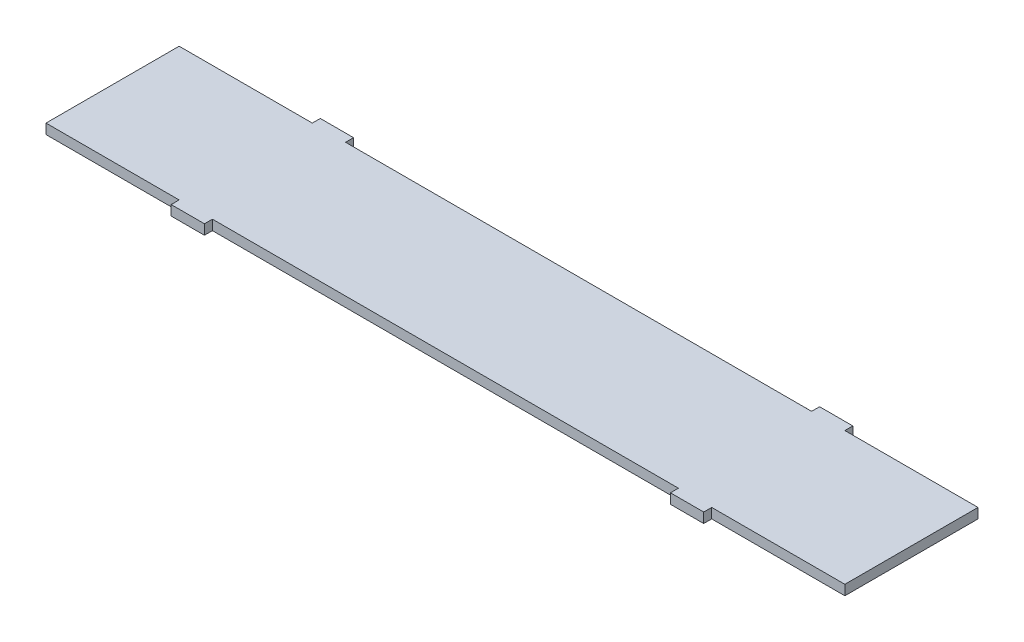
ISO-10303-21;
HEADER;
FILE_DESCRIPTION(('STEP AP214'),'2;1');
FILE_NAME('part.step','',(''),(''),'','','');
FILE_SCHEMA(('AUTOMOTIVE_DESIGN { 1 0 10303 214 1 1 1 1 }'));
ENDSEC;
DATA;
#1=APPLICATION_CONTEXT('core data for automotive mechanical design processes');
#2=APPLICATION_PROTOCOL_DEFINITION('international standard','automotive_design',2000,#1);
#3=PRODUCT_CONTEXT('',#1,'mechanical');
#4=PRODUCT('Part','Part','',(#3));
#5=PRODUCT_RELATED_PRODUCT_CATEGORY('part','',(#4));
#6=PRODUCT_DEFINITION_FORMATION('','',#4);
#7=PRODUCT_DEFINITION_CONTEXT('part definition',#1,'design');
#8=PRODUCT_DEFINITION('design','',#6,#7);
#9=PRODUCT_DEFINITION_SHAPE('','',#8);
#10=(LENGTH_UNIT() NAMED_UNIT(*) SI_UNIT(.MILLI.,.METRE.));
#11=(NAMED_UNIT(*) PLANE_ANGLE_UNIT() SI_UNIT($,.RADIAN.));
#12=(NAMED_UNIT(*) SI_UNIT($,.STERADIAN.) SOLID_ANGLE_UNIT());
#13=UNCERTAINTY_MEASURE_WITH_UNIT(LENGTH_MEASURE(1.E-05),#10,'distance_accuracy_value','');
#14=(GEOMETRIC_REPRESENTATION_CONTEXT(3) GLOBAL_UNCERTAINTY_ASSIGNED_CONTEXT((#13)) GLOBAL_UNIT_ASSIGNED_CONTEXT((#10,
#11,#12)) REPRESENTATION_CONTEXT('',''));
#15=CARTESIAN_POINT('',(0.,0.,0.));
#16=DIRECTION('',(0.,0.,1.));
#17=DIRECTION('',(1.,0.,0.));
#18=AXIS2_PLACEMENT_3D('',#15,#16,#17);
#19=CARTESIAN_POINT('',(-600.,15.,-100.));
#20=DIRECTION('',(0.,0.,1.));
#21=DIRECTION('',(1.,0.,0.));
#22=AXIS2_PLACEMENT_3D('',#19,#20,#21);
#23=PLANE('',#22);
#24=DIRECTION('',(0.,-1.,0.));
#25=VECTOR('',#24,1.);
#26=CARTESIAN_POINT('',(400.,15.,-100.));
#27=LINE('',#26,#25);
#28=CARTESIAN_POINT('',(400.,15.,-100.));
#29=VERTEX_POINT('',#28);
#30=CARTESIAN_POINT('',(400.,0.,-100.));
#31=VERTEX_POINT('',#30);
#32=EDGE_CURVE('E66',#29,#31,#27,.T.);
#33=ORIENTED_EDGE('',*,*,#32,.F.);
#34=DIRECTION('',(-1.,0.,0.));
#35=VECTOR('',#34,1.);
#36=CARTESIAN_POINT('',(-600.,15.,-100.));
#37=LINE('',#36,#35);
#38=CARTESIAN_POINT('',(600.,15.,-100.));
#39=VERTEX_POINT('',#38);
#40=EDGE_CURVE('E198',#39,#29,#37,.T.);
#41=ORIENTED_EDGE('',*,*,#40,.F.);
#42=DIRECTION('',(0.,-1.,0.));
#43=VECTOR('',#42,1.);
#44=CARTESIAN_POINT('',(600.,15.,-100.));
#45=LINE('',#44,#43);
#46=CARTESIAN_POINT('',(600.,0.,-100.));
#47=VERTEX_POINT('',#46);
#48=EDGE_CURVE('E12',#39,#47,#45,.T.);
#49=ORIENTED_EDGE('',*,*,#48,.T.);
#50=DIRECTION('',(-1.,0.,0.));
#51=VECTOR('',#50,1.);
#52=CARTESIAN_POINT('',(-600.,0.,-100.));
#53=LINE('',#52,#51);
#54=EDGE_CURVE('E356',#47,#31,#53,.T.);
#55=ORIENTED_EDGE('',*,*,#54,.T.);
#56=EDGE_LOOP('',(#33,#41,#49,#55));
#57=FACE_BOUND('',#56,.T.);
#58=ADVANCED_FACE('F42',(#57),#23,.F.);
#59=DIRECTION('',(0.,-1.,0.));
#60=VECTOR('',#59,1.);
#61=CARTESIAN_POINT('',(350.,15.,-100.));
#62=LINE('',#61,#60);
#63=CARTESIAN_POINT('',(350.,15.,-100.));
#64=VERTEX_POINT('',#63);
#65=CARTESIAN_POINT('',(350.,0.,-100.));
#66=VERTEX_POINT('',#65);
#67=EDGE_CURVE('E213',#64,#66,#62,.T.);
#68=ORIENTED_EDGE('',*,*,#67,.T.);
#69=CARTESIAN_POINT('',(-350.,0.,-100.));
#70=VERTEX_POINT('',#69);
#71=EDGE_CURVE('E344',#66,#70,#53,.T.);
#72=ORIENTED_EDGE('',*,*,#71,.T.);
#73=DIRECTION('',(0.,-1.,0.));
#74=VECTOR('',#73,1.);
#75=CARTESIAN_POINT('',(-350.,15.,-100.));
#76=LINE('',#75,#74);
#77=CARTESIAN_POINT('',(-350.,15.,-100.));
#78=VERTEX_POINT('',#77);
#79=EDGE_CURVE('E423',#78,#70,#76,.T.);
#80=ORIENTED_EDGE('',*,*,#79,.F.);
#81=EDGE_CURVE('E58',#64,#78,#37,.T.);
#82=ORIENTED_EDGE('',*,*,#81,.F.);
#83=EDGE_LOOP('',(#68,#72,#80,#82));
#84=FACE_BOUND('',#83,.T.);
#85=ADVANCED_FACE('F343',(#84),#23,.F.);
#86=CARTESIAN_POINT('',(-600.,15.,100.));
#87=DIRECTION('',(0.,0.,-1.));
#88=DIRECTION('',(-1.,0.,0.));
#89=AXIS2_PLACEMENT_3D('',#86,#87,#88);
#90=PLANE('',#89);
#91=DIRECTION('',(0.,-1.,0.));
#92=VECTOR('',#91,1.);
#93=CARTESIAN_POINT('',(350.,15.,100.));
#94=LINE('',#93,#92);
#95=CARTESIAN_POINT('',(350.,15.,100.));
#96=VERTEX_POINT('',#95);
#97=CARTESIAN_POINT('',(350.,0.,100.));
#98=VERTEX_POINT('',#97);
#99=EDGE_CURVE('E251',#96,#98,#94,.T.);
#100=ORIENTED_EDGE('',*,*,#99,.F.);
#101=DIRECTION('',(1.,0.,0.));
#102=VECTOR('',#101,1.);
#103=CARTESIAN_POINT('',(-600.,15.,100.));
#104=LINE('',#103,#102);
#105=CARTESIAN_POINT('',(-350.,15.,100.));
#106=VERTEX_POINT('',#105);
#107=EDGE_CURVE('E401',#106,#96,#104,.T.);
#108=ORIENTED_EDGE('',*,*,#107,.F.);
#109=DIRECTION('',(0.,-1.,0.));
#110=VECTOR('',#109,1.);
#111=CARTESIAN_POINT('',(-350.,15.,100.));
#112=LINE('',#111,#110);
#113=CARTESIAN_POINT('',(-350.,0.,100.));
#114=VERTEX_POINT('',#113);
#115=EDGE_CURVE('E272',#106,#114,#112,.T.);
#116=ORIENTED_EDGE('',*,*,#115,.T.);
#117=DIRECTION('',(1.,0.,0.));
#118=VECTOR('',#117,1.);
#119=CARTESIAN_POINT('',(-600.,0.,100.));
#120=LINE('',#119,#118);
#121=EDGE_CURVE('E372',#114,#98,#120,.T.);
#122=ORIENTED_EDGE('',*,*,#121,.T.);
#123=EDGE_LOOP('',(#100,#108,#116,#122));
#124=FACE_BOUND('',#123,.T.);
#125=ADVANCED_FACE('F468',(#124),#90,.F.);
#126=DIRECTION('',(0.,-1.,0.));
#127=VECTOR('',#126,1.);
#128=CARTESIAN_POINT('',(400.,15.,100.));
#129=LINE('',#128,#127);
#130=CARTESIAN_POINT('',(400.,15.,100.));
#131=VERTEX_POINT('',#130);
#132=CARTESIAN_POINT('',(400.,0.,100.));
#133=VERTEX_POINT('',#132);
#134=EDGE_CURVE('E233',#131,#133,#129,.T.);
#135=ORIENTED_EDGE('',*,*,#134,.T.);
#136=CARTESIAN_POINT('',(600.,0.,100.));
#137=VERTEX_POINT('',#136);
#138=EDGE_CURVE('E367',#133,#137,#120,.T.);
#139=ORIENTED_EDGE('',*,*,#138,.T.);
#140=DIRECTION('',(0.,-1.,0.));
#141=VECTOR('',#140,1.);
#142=CARTESIAN_POINT('',(600.,15.,100.));
#143=LINE('',#142,#141);
#144=CARTESIAN_POINT('',(600.,15.,100.));
#145=VERTEX_POINT('',#144);
#146=EDGE_CURVE('E373',#145,#137,#143,.T.);
#147=ORIENTED_EDGE('',*,*,#146,.F.);
#148=EDGE_CURVE('E402',#131,#145,#104,.T.);
#149=ORIENTED_EDGE('',*,*,#148,.F.);
#150=EDGE_LOOP('',(#135,#139,#147,#149));
#151=FACE_BOUND('',#150,.T.);
#152=ADVANCED_FACE('F478',(#151),#90,.F.);
#153=DIRECTION('',(0.,-1.,0.));
#154=VECTOR('',#153,1.);
#155=CARTESIAN_POINT('',(-400.,15.,100.));
#156=LINE('',#155,#154);
#157=CARTESIAN_POINT('',(-400.,15.,100.));
#158=VERTEX_POINT('',#157);
#159=CARTESIAN_POINT('',(-400.,0.,100.));
#160=VERTEX_POINT('',#159);
#161=EDGE_CURVE('E291',#158,#160,#156,.T.);
#162=ORIENTED_EDGE('',*,*,#161,.F.);
#163=CARTESIAN_POINT('',(-600.,15.,100.));
#164=VERTEX_POINT('',#163);
#165=EDGE_CURVE('E378',#164,#158,#104,.T.);
#166=ORIENTED_EDGE('',*,*,#165,.F.);
#167=DIRECTION('',(0.,-1.,0.));
#168=VECTOR('',#167,1.);
#169=CARTESIAN_POINT('',(-600.,15.,100.));
#170=LINE('',#169,#168);
#171=CARTESIAN_POINT('',(-600.,0.,100.));
#172=VERTEX_POINT('',#171);
#173=EDGE_CURVE('E377',#164,#172,#170,.T.);
#174=ORIENTED_EDGE('',*,*,#173,.T.);
#175=EDGE_CURVE('E368',#172,#160,#120,.T.);
#176=ORIENTED_EDGE('',*,*,#175,.T.);
#177=EDGE_LOOP('',(#162,#166,#174,#176));
#178=FACE_BOUND('',#177,.T.);
#179=ADVANCED_FACE('F397',(#178),#90,.F.);
#180=CARTESIAN_POINT('',(600.,15.,100.));
#181=DIRECTION('',(-1.,0.,0.));
#182=DIRECTION('',(0.,0.,1.));
#183=AXIS2_PLACEMENT_3D('',#180,#181,#182);
#184=PLANE('',#183);
#185=DIRECTION('',(0.,0.,-1.));
#186=VECTOR('',#185,1.);
#187=CARTESIAN_POINT('',(600.,0.,100.));
#188=LINE('',#187,#186);
#189=EDGE_CURVE('E362',#137,#47,#188,.T.);
#190=ORIENTED_EDGE('',*,*,#189,.T.);
#191=ORIENTED_EDGE('',*,*,#48,.F.);
#192=DIRECTION('',(0.,0.,-1.));
#193=VECTOR('',#192,1.);
#194=CARTESIAN_POINT('',(600.,15.,100.));
#195=LINE('',#194,#193);
#196=EDGE_CURVE('E315',#145,#39,#195,.T.);
#197=ORIENTED_EDGE('',*,*,#196,.F.);
#198=ORIENTED_EDGE('',*,*,#146,.T.);
#199=EDGE_LOOP('',(#190,#191,#197,#198));
#200=FACE_BOUND('',#199,.T.);
#201=ADVANCED_FACE('F44',(#200),#184,.F.);
#202=CARTESIAN_POINT('',(-400.,15.,-100.));
#203=VERTEX_POINT('',#202);
#204=CARTESIAN_POINT('',(-600.,15.,-100.));
#205=VERTEX_POINT('',#204);
#206=EDGE_CURVE('E314',#203,#205,#37,.T.);
#207=ORIENTED_EDGE('',*,*,#206,.F.);
#208=DIRECTION('',(0.,-1.,0.));
#209=VECTOR('',#208,1.);
#210=CARTESIAN_POINT('',(-400.,15.,-100.));
#211=LINE('',#210,#209);
#212=CARTESIAN_POINT('',(-400.,0.,-100.));
#213=VERTEX_POINT('',#212);
#214=EDGE_CURVE('E421',#203,#213,#211,.T.);
#215=ORIENTED_EDGE('',*,*,#214,.T.);
#216=CARTESIAN_POINT('',(-600.,0.,-100.));
#217=VERTEX_POINT('',#216);
#218=EDGE_CURVE('E357',#213,#217,#53,.T.);
#219=ORIENTED_EDGE('',*,*,#218,.T.);
#220=DIRECTION('',(0.,-1.,0.));
#221=VECTOR('',#220,1.);
#222=CARTESIAN_POINT('',(-600.,15.,-100.));
#223=LINE('',#222,#221);
#224=EDGE_CURVE('E51',#205,#217,#223,.T.);
#225=ORIENTED_EDGE('',*,*,#224,.F.);
#226=EDGE_LOOP('',(#207,#215,#219,#225));
#227=FACE_BOUND('',#226,.T.);
#228=ADVANCED_FACE('F464',(#227),#23,.F.);
#229=CARTESIAN_POINT('',(-600.,15.,100.));
#230=DIRECTION('',(1.,0.,0.));
#231=DIRECTION('',(0.,0.,-1.));
#232=AXIS2_PLACEMENT_3D('',#229,#230,#231);
#233=PLANE('',#232);
#234=DIRECTION('',(0.,0.,1.));
#235=VECTOR('',#234,1.);
#236=CARTESIAN_POINT('',(-600.,0.,100.));
#237=LINE('',#236,#235);
#238=EDGE_CURVE('E361',#217,#172,#237,.T.);
#239=ORIENTED_EDGE('',*,*,#238,.T.);
#240=ORIENTED_EDGE('',*,*,#173,.F.);
#241=DIRECTION('',(0.,0.,1.));
#242=VECTOR('',#241,1.);
#243=CARTESIAN_POINT('',(-600.,15.,100.));
#244=LINE('',#243,#242);
#245=EDGE_CURVE('E313',#205,#164,#244,.T.);
#246=ORIENTED_EDGE('',*,*,#245,.F.);
#247=ORIENTED_EDGE('',*,*,#224,.T.);
#248=EDGE_LOOP('',(#239,#240,#246,#247));
#249=FACE_BOUND('',#248,.T.);
#250=ADVANCED_FACE('F387',(#249),#233,.F.);
#251=CARTESIAN_POINT('',(0.,15.,0.));
#252=DIRECTION('',(0.,-1.,0.));
#253=DIRECTION('',(0.,0.,-1.));
#254=AXIS2_PLACEMENT_3D('',#251,#252,#253);
#255=PLANE('',#254);
#256=ORIENTED_EDGE('',*,*,#196,.T.);
#257=ORIENTED_EDGE('',*,*,#40,.T.);
#258=DIRECTION('',(0.,0.,-1.));
#259=VECTOR('',#258,1.);
#260=CARTESIAN_POINT('',(400.,15.,-100.));
#261=LINE('',#260,#259);
#262=CARTESIAN_POINT('',(400.,15.,-112.));
#263=VERTEX_POINT('',#262);
#264=EDGE_CURVE('E193',#29,#263,#261,.T.);
#265=ORIENTED_EDGE('',*,*,#264,.T.);
#266=DIRECTION('',(-1.,0.,0.));
#267=VECTOR('',#266,1.);
#268=CARTESIAN_POINT('',(400.,15.,-112.));
#269=LINE('',#268,#267);
#270=CARTESIAN_POINT('',(350.,15.,-112.));
#271=VERTEX_POINT('',#270);
#272=EDGE_CURVE('E181',#263,#271,#269,.T.);
#273=ORIENTED_EDGE('',*,*,#272,.T.);
#274=DIRECTION('',(0.,0.,1.));
#275=VECTOR('',#274,1.);
#276=CARTESIAN_POINT('',(350.,15.,-100.));
#277=LINE('',#276,#275);
#278=EDGE_CURVE('E192',#271,#64,#277,.T.);
#279=ORIENTED_EDGE('',*,*,#278,.T.);
#280=ORIENTED_EDGE('',*,*,#81,.T.);
#281=DIRECTION('',(0.,0.,-1.));
#282=VECTOR('',#281,1.);
#283=CARTESIAN_POINT('',(-350.,15.,-100.));
#284=LINE('',#283,#282);
#285=CARTESIAN_POINT('',(-350.,15.,-112.));
#286=VERTEX_POINT('',#285);
#287=EDGE_CURVE('E300',#78,#286,#284,.T.);
#288=ORIENTED_EDGE('',*,*,#287,.T.);
#289=DIRECTION('',(-1.,0.,0.));
#290=VECTOR('',#289,1.);
#291=CARTESIAN_POINT('',(-400.,15.,-112.));
#292=LINE('',#291,#290);
#293=CARTESIAN_POINT('',(-400.,15.,-112.));
#294=VERTEX_POINT('',#293);
#295=EDGE_CURVE('E435',#286,#294,#292,.T.);
#296=ORIENTED_EDGE('',*,*,#295,.T.);
#297=DIRECTION('',(0.,0.,1.));
#298=VECTOR('',#297,1.);
#299=CARTESIAN_POINT('',(-400.,15.,-100.));
#300=LINE('',#299,#298);
#301=EDGE_CURVE('E296',#294,#203,#300,.T.);
#302=ORIENTED_EDGE('',*,*,#301,.T.);
#303=ORIENTED_EDGE('',*,*,#206,.T.);
#304=ORIENTED_EDGE('',*,*,#245,.T.);
#305=ORIENTED_EDGE('',*,*,#165,.T.);
#306=DIRECTION('',(0.,0.,1.));
#307=VECTOR('',#306,1.);
#308=CARTESIAN_POINT('',(-400.,15.,100.));
#309=LINE('',#308,#307);
#310=CARTESIAN_POINT('',(-400.,15.,112.));
#311=VERTEX_POINT('',#310);
#312=EDGE_CURVE('E256',#158,#311,#309,.T.);
#313=ORIENTED_EDGE('',*,*,#312,.T.);
#314=DIRECTION('',(1.,0.,0.));
#315=VECTOR('',#314,1.);
#316=CARTESIAN_POINT('',(-400.,15.,112.));
#317=LINE('',#316,#315);
#318=CARTESIAN_POINT('',(-350.,15.,112.));
#319=VERTEX_POINT('',#318);
#320=EDGE_CURVE('E260',#311,#319,#317,.T.);
#321=ORIENTED_EDGE('',*,*,#320,.T.);
#322=DIRECTION('',(0.,0.,-1.));
#323=VECTOR('',#322,1.);
#324=CARTESIAN_POINT('',(-350.,15.,100.));
#325=LINE('',#324,#323);
#326=EDGE_CURVE('E268',#319,#106,#325,.T.);
#327=ORIENTED_EDGE('',*,*,#326,.T.);
#328=ORIENTED_EDGE('',*,*,#107,.T.);
#329=DIRECTION('',(0.,0.,1.));
#330=VECTOR('',#329,1.);
#331=CARTESIAN_POINT('',(350.,15.,100.));
#332=LINE('',#331,#330);
#333=CARTESIAN_POINT('',(350.,15.,112.));
#334=VERTEX_POINT('',#333);
#335=EDGE_CURVE('E217',#96,#334,#332,.T.);
#336=ORIENTED_EDGE('',*,*,#335,.T.);
#337=DIRECTION('',(1.,0.,0.));
#338=VECTOR('',#337,1.);
#339=CARTESIAN_POINT('',(400.,15.,112.));
#340=LINE('',#339,#338);
#341=CARTESIAN_POINT('',(400.,15.,112.));
#342=VERTEX_POINT('',#341);
#343=EDGE_CURVE('E221',#334,#342,#340,.T.);
#344=ORIENTED_EDGE('',*,*,#343,.T.);
#345=DIRECTION('',(0.,0.,-1.));
#346=VECTOR('',#345,1.);
#347=CARTESIAN_POINT('',(400.,15.,100.));
#348=LINE('',#347,#346);
#349=EDGE_CURVE('E229',#342,#131,#348,.T.);
#350=ORIENTED_EDGE('',*,*,#349,.T.);
#351=ORIENTED_EDGE('',*,*,#148,.T.);
#352=EDGE_LOOP('',(#256,#257,#265,#273,#279,#280,#288,#296,#302,#303,#304,#305,#313,#321,#327,
#328,#336,#344,#350,#351));
#353=FACE_BOUND('',#352,.T.);
#354=ADVANCED_FACE('F197',(#353),#255,.F.);
#355=CARTESIAN_POINT('',(0.,0.,0.));
#356=DIRECTION('',(0.,-1.,0.));
#357=DIRECTION('',(0.,0.,-1.));
#358=AXIS2_PLACEMENT_3D('',#355,#356,#357);
#359=PLANE('',#358);
#360=ORIENTED_EDGE('',*,*,#189,.F.);
#361=ORIENTED_EDGE('',*,*,#138,.F.);
#362=DIRECTION('',(0.,0.,-1.));
#363=VECTOR('',#362,1.);
#364=CARTESIAN_POINT('',(400.,0.,100.));
#365=LINE('',#364,#363);
#366=CARTESIAN_POINT('',(400.,0.,112.));
#367=VERTEX_POINT('',#366);
#368=EDGE_CURVE('E222',#367,#133,#365,.T.);
#369=ORIENTED_EDGE('',*,*,#368,.F.);
#370=DIRECTION('',(1.,0.,0.));
#371=VECTOR('',#370,1.);
#372=CARTESIAN_POINT('',(400.,0.,112.));
#373=LINE('',#372,#371);
#374=CARTESIAN_POINT('',(350.,0.,112.));
#375=VERTEX_POINT('',#374);
#376=EDGE_CURVE('E211',#375,#367,#373,.T.);
#377=ORIENTED_EDGE('',*,*,#376,.F.);
#378=DIRECTION('',(0.,0.,1.));
#379=VECTOR('',#378,1.);
#380=CARTESIAN_POINT('',(350.,0.,100.));
#381=LINE('',#380,#379);
#382=EDGE_CURVE('E207',#98,#375,#381,.T.);
#383=ORIENTED_EDGE('',*,*,#382,.F.);
#384=ORIENTED_EDGE('',*,*,#121,.F.);
#385=DIRECTION('',(0.,0.,-1.));
#386=VECTOR('',#385,1.);
#387=CARTESIAN_POINT('',(-350.,0.,100.));
#388=LINE('',#387,#386);
#389=CARTESIAN_POINT('',(-350.,0.,112.));
#390=VERTEX_POINT('',#389);
#391=EDGE_CURVE('E261',#390,#114,#388,.T.);
#392=ORIENTED_EDGE('',*,*,#391,.F.);
#393=DIRECTION('',(1.,0.,0.));
#394=VECTOR('',#393,1.);
#395=CARTESIAN_POINT('',(-400.,0.,112.));
#396=LINE('',#395,#394);
#397=CARTESIAN_POINT('',(-400.,0.,112.));
#398=VERTEX_POINT('',#397);
#399=EDGE_CURVE('E275',#398,#390,#396,.T.);
#400=ORIENTED_EDGE('',*,*,#399,.F.);
#401=DIRECTION('',(0.,0.,1.));
#402=VECTOR('',#401,1.);
#403=CARTESIAN_POINT('',(-400.,0.,100.));
#404=LINE('',#403,#402);
#405=EDGE_CURVE('E255',#160,#398,#404,.T.);
#406=ORIENTED_EDGE('',*,*,#405,.F.);
#407=ORIENTED_EDGE('',*,*,#175,.F.);
#408=ORIENTED_EDGE('',*,*,#238,.F.);
#409=ORIENTED_EDGE('',*,*,#218,.F.);
#410=DIRECTION('',(0.,0.,1.));
#411=VECTOR('',#410,1.);
#412=CARTESIAN_POINT('',(-400.,0.,-100.));
#413=LINE('',#412,#411);
#414=CARTESIAN_POINT('',(-400.,0.,-112.));
#415=VERTEX_POINT('',#414);
#416=EDGE_CURVE('E295',#415,#213,#413,.T.);
#417=ORIENTED_EDGE('',*,*,#416,.F.);
#418=DIRECTION('',(-1.,0.,0.));
#419=VECTOR('',#418,1.);
#420=CARTESIAN_POINT('',(-400.,0.,-112.));
#421=LINE('',#420,#419);
#422=CARTESIAN_POINT('',(-350.,0.,-112.));
#423=VERTEX_POINT('',#422);
#424=EDGE_CURVE('E301',#423,#415,#421,.T.);
#425=ORIENTED_EDGE('',*,*,#424,.F.);
#426=DIRECTION('',(0.,0.,-1.));
#427=VECTOR('',#426,1.);
#428=CARTESIAN_POINT('',(-350.,0.,-100.));
#429=LINE('',#428,#427);
#430=EDGE_CURVE('E354',#70,#423,#429,.T.);
#431=ORIENTED_EDGE('',*,*,#430,.F.);
#432=ORIENTED_EDGE('',*,*,#71,.F.);
#433=DIRECTION('',(0.,0.,1.));
#434=VECTOR('',#433,1.);
#435=CARTESIAN_POINT('',(350.,0.,-100.));
#436=LINE('',#435,#434);
#437=CARTESIAN_POINT('',(350.,0.,-112.));
#438=VERTEX_POINT('',#437);
#439=EDGE_CURVE('E201',#438,#66,#436,.T.);
#440=ORIENTED_EDGE('',*,*,#439,.F.);
#441=DIRECTION('',(-1.,0.,0.));
#442=VECTOR('',#441,1.);
#443=CARTESIAN_POINT('',(400.,0.,-112.));
#444=LINE('',#443,#442);
#445=CARTESIAN_POINT('',(400.,0.,-112.));
#446=VERTEX_POINT('',#445);
#447=EDGE_CURVE('E334',#446,#438,#444,.T.);
#448=ORIENTED_EDGE('',*,*,#447,.F.);
#449=DIRECTION('',(0.,0.,-1.));
#450=VECTOR('',#449,1.);
#451=CARTESIAN_POINT('',(400.,0.,-100.));
#452=LINE('',#451,#450);
#453=EDGE_CURVE('E205',#31,#446,#452,.T.);
#454=ORIENTED_EDGE('',*,*,#453,.F.);
#455=ORIENTED_EDGE('',*,*,#54,.F.);
#456=EDGE_LOOP('',(#360,#361,#369,#377,#383,#384,#392,#400,#406,#407,#408,#409,#417,#425,#431,
#432,#440,#448,#454,#455));
#457=FACE_BOUND('',#456,.T.);
#458=ADVANCED_FACE('F351',(#457),#359,.T.);
#459=CARTESIAN_POINT('',(-400.,15.,-100.));
#460=DIRECTION('',(1.,0.,0.));
#461=DIRECTION('',(0.,0.,-1.));
#462=AXIS2_PLACEMENT_3D('',#459,#460,#461);
#463=PLANE('',#462);
#464=ORIENTED_EDGE('',*,*,#416,.T.);
#465=ORIENTED_EDGE('',*,*,#214,.F.);
#466=ORIENTED_EDGE('',*,*,#301,.F.);
#467=DIRECTION('',(0.,-1.,0.));
#468=VECTOR('',#467,1.);
#469=CARTESIAN_POINT('',(-400.,15.,-112.));
#470=LINE('',#469,#468);
#471=EDGE_CURVE('E431',#294,#415,#470,.T.);
#472=ORIENTED_EDGE('',*,*,#471,.T.);
#473=EDGE_LOOP('',(#464,#465,#466,#472));
#474=FACE_BOUND('',#473,.T.);
#475=ADVANCED_FACE('F453',(#474),#463,.F.);
#476=CARTESIAN_POINT('',(-350.,15.,-100.));
#477=DIRECTION('',(-1.,0.,0.));
#478=DIRECTION('',(0.,0.,1.));
#479=AXIS2_PLACEMENT_3D('',#476,#477,#478);
#480=PLANE('',#479);
#481=ORIENTED_EDGE('',*,*,#430,.T.);
#482=DIRECTION('',(0.,-1.,0.));
#483=VECTOR('',#482,1.);
#484=CARTESIAN_POINT('',(-350.,15.,-112.));
#485=LINE('',#484,#483);
#486=EDGE_CURVE('E425',#286,#423,#485,.T.);
#487=ORIENTED_EDGE('',*,*,#486,.F.);
#488=ORIENTED_EDGE('',*,*,#287,.F.);
#489=ORIENTED_EDGE('',*,*,#79,.T.);
#490=EDGE_LOOP('',(#481,#487,#488,#489));
#491=FACE_BOUND('',#490,.T.);
#492=ADVANCED_FACE('F449',(#491),#480,.F.);
#493=CARTESIAN_POINT('',(-400.,15.,-112.));
#494=DIRECTION('',(0.,0.,1.));
#495=DIRECTION('',(1.,0.,0.));
#496=AXIS2_PLACEMENT_3D('',#493,#494,#495);
#497=PLANE('',#496);
#498=ORIENTED_EDGE('',*,*,#424,.T.);
#499=ORIENTED_EDGE('',*,*,#471,.F.);
#500=ORIENTED_EDGE('',*,*,#295,.F.);
#501=ORIENTED_EDGE('',*,*,#486,.T.);
#502=EDGE_LOOP('',(#498,#499,#500,#501));
#503=FACE_BOUND('',#502,.T.);
#504=ADVANCED_FACE('F451',(#503),#497,.F.);
#505=CARTESIAN_POINT('',(-400.,15.,100.));
#506=DIRECTION('',(1.,0.,0.));
#507=DIRECTION('',(0.,0.,-1.));
#508=AXIS2_PLACEMENT_3D('',#505,#506,#507);
#509=PLANE('',#508);
#510=ORIENTED_EDGE('',*,*,#405,.T.);
#511=DIRECTION('',(0.,-1.,0.));
#512=VECTOR('',#511,1.);
#513=CARTESIAN_POINT('',(-400.,15.,112.));
#514=LINE('',#513,#512);
#515=EDGE_CURVE('E287',#311,#398,#514,.T.);
#516=ORIENTED_EDGE('',*,*,#515,.F.);
#517=ORIENTED_EDGE('',*,*,#312,.F.);
#518=ORIENTED_EDGE('',*,*,#161,.T.);
#519=EDGE_LOOP('',(#510,#516,#517,#518));
#520=FACE_BOUND('',#519,.T.);
#521=ADVANCED_FACE('F534',(#520),#509,.F.);
#522=CARTESIAN_POINT('',(-400.,15.,112.));
#523=DIRECTION('',(0.,0.,-1.));
#524=DIRECTION('',(-1.,0.,0.));
#525=AXIS2_PLACEMENT_3D('',#522,#523,#524);
#526=PLANE('',#525);
#527=ORIENTED_EDGE('',*,*,#399,.T.);
#528=DIRECTION('',(0.,-1.,0.));
#529=VECTOR('',#528,1.);
#530=CARTESIAN_POINT('',(-350.,15.,112.));
#531=LINE('',#530,#529);
#532=EDGE_CURVE('E283',#319,#390,#531,.T.);
#533=ORIENTED_EDGE('',*,*,#532,.F.);
#534=ORIENTED_EDGE('',*,*,#320,.F.);
#535=ORIENTED_EDGE('',*,*,#515,.T.);
#536=EDGE_LOOP('',(#527,#533,#534,#535));
#537=FACE_BOUND('',#536,.T.);
#538=ADVANCED_FACE('F509',(#537),#526,.F.);
#539=CARTESIAN_POINT('',(-350.,15.,100.));
#540=DIRECTION('',(-1.,0.,0.));
#541=DIRECTION('',(0.,0.,1.));
#542=AXIS2_PLACEMENT_3D('',#539,#540,#541);
#543=PLANE('',#542);
#544=ORIENTED_EDGE('',*,*,#391,.T.);
#545=ORIENTED_EDGE('',*,*,#115,.F.);
#546=ORIENTED_EDGE('',*,*,#326,.F.);
#547=ORIENTED_EDGE('',*,*,#532,.T.);
#548=EDGE_LOOP('',(#544,#545,#546,#547));
#549=FACE_BOUND('',#548,.T.);
#550=ADVANCED_FACE('F512',(#549),#543,.F.);
#551=CARTESIAN_POINT('',(350.,15.,100.));
#552=DIRECTION('',(1.,0.,0.));
#553=DIRECTION('',(0.,0.,-1.));
#554=AXIS2_PLACEMENT_3D('',#551,#552,#553);
#555=PLANE('',#554);
#556=ORIENTED_EDGE('',*,*,#382,.T.);
#557=DIRECTION('',(0.,-1.,0.));
#558=VECTOR('',#557,1.);
#559=CARTESIAN_POINT('',(350.,15.,112.));
#560=LINE('',#559,#558);
#561=EDGE_CURVE('E247',#334,#375,#560,.T.);
#562=ORIENTED_EDGE('',*,*,#561,.F.);
#563=ORIENTED_EDGE('',*,*,#335,.F.);
#564=ORIENTED_EDGE('',*,*,#99,.T.);
#565=EDGE_LOOP('',(#556,#562,#563,#564));
#566=FACE_BOUND('',#565,.T.);
#567=ADVANCED_FACE('F496',(#566),#555,.F.);
#568=CARTESIAN_POINT('',(400.,15.,112.));
#569=DIRECTION('',(0.,0.,-1.));
#570=DIRECTION('',(-1.,0.,0.));
#571=AXIS2_PLACEMENT_3D('',#568,#569,#570);
#572=PLANE('',#571);
#573=ORIENTED_EDGE('',*,*,#376,.T.);
#574=DIRECTION('',(0.,-1.,0.));
#575=VECTOR('',#574,1.);
#576=CARTESIAN_POINT('',(400.,15.,112.));
#577=LINE('',#576,#575);
#578=EDGE_CURVE('E243',#342,#367,#577,.T.);
#579=ORIENTED_EDGE('',*,*,#578,.F.);
#580=ORIENTED_EDGE('',*,*,#343,.F.);
#581=ORIENTED_EDGE('',*,*,#561,.T.);
#582=EDGE_LOOP('',(#573,#579,#580,#581));
#583=FACE_BOUND('',#582,.T.);
#584=ADVANCED_FACE('F501',(#583),#572,.F.);
#585=CARTESIAN_POINT('',(400.,15.,100.));
#586=DIRECTION('',(-1.,0.,0.));
#587=DIRECTION('',(0.,0.,1.));
#588=AXIS2_PLACEMENT_3D('',#585,#586,#587);
#589=PLANE('',#588);
#590=ORIENTED_EDGE('',*,*,#368,.T.);
#591=ORIENTED_EDGE('',*,*,#134,.F.);
#592=ORIENTED_EDGE('',*,*,#349,.F.);
#593=ORIENTED_EDGE('',*,*,#578,.T.);
#594=EDGE_LOOP('',(#590,#591,#592,#593));
#595=FACE_BOUND('',#594,.T.);
#596=ADVANCED_FACE('F517',(#595),#589,.F.);
#597=CARTESIAN_POINT('',(400.,15.,-100.));
#598=DIRECTION('',(-1.,0.,0.));
#599=DIRECTION('',(0.,0.,1.));
#600=AXIS2_PLACEMENT_3D('',#597,#598,#599);
#601=PLANE('',#600);
#602=ORIENTED_EDGE('',*,*,#453,.T.);
#603=DIRECTION('',(0.,-1.,0.));
#604=VECTOR('',#603,1.);
#605=CARTESIAN_POINT('',(400.,15.,-112.));
#606=LINE('',#605,#604);
#607=EDGE_CURVE('E185',#263,#446,#606,.T.);
#608=ORIENTED_EDGE('',*,*,#607,.F.);
#609=ORIENTED_EDGE('',*,*,#264,.F.);
#610=ORIENTED_EDGE('',*,*,#32,.T.);
#611=EDGE_LOOP('',(#602,#608,#609,#610));
#612=FACE_BOUND('',#611,.T.);
#613=ADVANCED_FACE('F203',(#612),#601,.F.);
#614=CARTESIAN_POINT('',(400.,15.,-112.));
#615=DIRECTION('',(0.,0.,1.));
#616=DIRECTION('',(1.,0.,0.));
#617=AXIS2_PLACEMENT_3D('',#614,#615,#616);
#618=PLANE('',#617);
#619=ORIENTED_EDGE('',*,*,#447,.T.);
#620=DIRECTION('',(0.,-1.,0.));
#621=VECTOR('',#620,1.);
#622=CARTESIAN_POINT('',(350.,15.,-112.));
#623=LINE('',#622,#621);
#624=EDGE_CURVE('E188',#271,#438,#623,.T.);
#625=ORIENTED_EDGE('',*,*,#624,.F.);
#626=ORIENTED_EDGE('',*,*,#272,.F.);
#627=ORIENTED_EDGE('',*,*,#607,.T.);
#628=EDGE_LOOP('',(#619,#625,#626,#627));
#629=FACE_BOUND('',#628,.T.);
#630=ADVANCED_FACE('F183',(#629),#618,.F.);
#631=CARTESIAN_POINT('',(350.,15.,-100.));
#632=DIRECTION('',(1.,0.,0.));
#633=DIRECTION('',(0.,0.,-1.));
#634=AXIS2_PLACEMENT_3D('',#631,#632,#633);
#635=PLANE('',#634);
#636=ORIENTED_EDGE('',*,*,#439,.T.);
#637=ORIENTED_EDGE('',*,*,#67,.F.);
#638=ORIENTED_EDGE('',*,*,#278,.F.);
#639=ORIENTED_EDGE('',*,*,#624,.T.);
#640=EDGE_LOOP('',(#636,#637,#638,#639));
#641=FACE_BOUND('',#640,.T.);
#642=ADVANCED_FACE('F348',(#641),#635,.F.);
#643=CLOSED_SHELL('',(#58,#85,#125,#152,#179,#201,#228,#250,#354,#458,#475,#492,#504,#521,#538,
#550,#567,#584,#596,#613,#630,#642));
#644=MANIFOLD_SOLID_BREP('B2',#643);
#645=ADVANCED_BREP_SHAPE_REPRESENTATION('',(#18,#644),#14);
#646=SHAPE_DEFINITION_REPRESENTATION(#9,#645);
ENDSEC;
END-ISO-10303-21;
